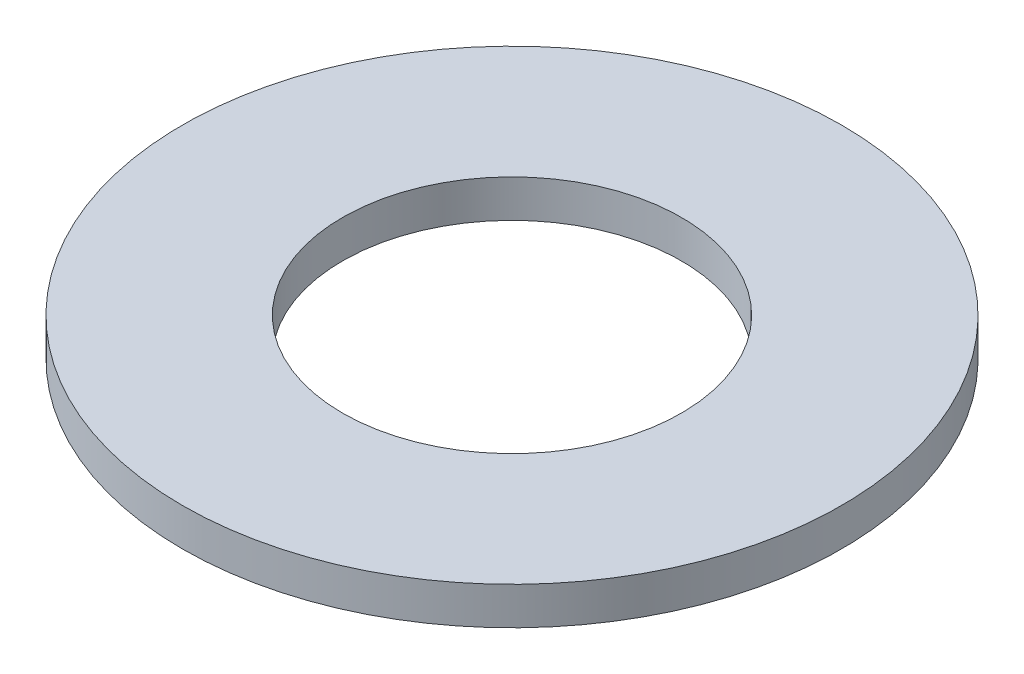
ISO-10303-21;
HEADER;
FILE_DESCRIPTION(('STEP AP214'),'2;1');
FILE_NAME('part.step','',(''),(''),'','','');
FILE_SCHEMA(('AUTOMOTIVE_DESIGN { 1 0 10303 214 1 1 1 1 }'));
ENDSEC;
DATA;
#1=APPLICATION_CONTEXT('core data for automotive mechanical design processes');
#2=APPLICATION_PROTOCOL_DEFINITION('international standard','automotive_design',2000,#1);
#3=PRODUCT_CONTEXT('',#1,'mechanical');
#4=PRODUCT('Part','Part','',(#3));
#5=PRODUCT_RELATED_PRODUCT_CATEGORY('part','',(#4));
#6=PRODUCT_DEFINITION_FORMATION('','',#4);
#7=PRODUCT_DEFINITION_CONTEXT('part definition',#1,'design');
#8=PRODUCT_DEFINITION('design','',#6,#7);
#9=PRODUCT_DEFINITION_SHAPE('','',#8);
#10=(LENGTH_UNIT() NAMED_UNIT(*) SI_UNIT(.MILLI.,.METRE.));
#11=(NAMED_UNIT(*) PLANE_ANGLE_UNIT() SI_UNIT($,.RADIAN.));
#12=(NAMED_UNIT(*) SI_UNIT($,.STERADIAN.) SOLID_ANGLE_UNIT());
#13=UNCERTAINTY_MEASURE_WITH_UNIT(LENGTH_MEASURE(1.E-05),#10,'distance_accuracy_value','');
#14=(GEOMETRIC_REPRESENTATION_CONTEXT(3) GLOBAL_UNCERTAINTY_ASSIGNED_CONTEXT((#13)) GLOBAL_UNIT_ASSIGNED_CONTEXT((#10,
#11,#12)) REPRESENTATION_CONTEXT('',''));
#15=CARTESIAN_POINT('',(0.,0.,0.));
#16=DIRECTION('',(0.,0.,1.));
#17=DIRECTION('',(1.,0.,0.));
#18=AXIS2_PLACEMENT_3D('',#15,#16,#17);
#19=CARTESIAN_POINT('',(0.,10.,0.));
#20=DIRECTION('',(0.,-1.,0.));
#21=DIRECTION('',(0.,0.,-1.));
#22=AXIS2_PLACEMENT_3D('',#19,#20,#21);
#23=CYLINDRICAL_SURFACE('',#22,87.5);
#24=CARTESIAN_POINT('',(0.,10.,0.));
#25=DIRECTION('',(0.,1.,0.));
#26=DIRECTION('',(0.,0.,1.));
#27=AXIS2_PLACEMENT_3D('',#24,#25,#26);
#28=CIRCLE('',#27,87.5);
#29=CARTESIAN_POINT('',(0.,10.,87.5));
#30=VERTEX_POINT('',#29);
#31=EDGE_CURVE('E10',#30,#30,#28,.T.);
#32=ORIENTED_EDGE('',*,*,#31,.F.);
#33=EDGE_LOOP('',(#32));
#34=FACE_BOUND('',#33,.T.);
#35=CARTESIAN_POINT('',(0.,0.,0.));
#36=DIRECTION('',(0.,1.,0.));
#37=DIRECTION('',(0.,0.,1.));
#38=AXIS2_PLACEMENT_3D('',#35,#36,#37);
#39=CIRCLE('',#38,87.5);
#40=CARTESIAN_POINT('',(0.,0.,87.5));
#41=VERTEX_POINT('',#40);
#42=EDGE_CURVE('E37',#41,#41,#39,.T.);
#43=ORIENTED_EDGE('',*,*,#42,.T.);
#44=EDGE_LOOP('',(#43));
#45=FACE_BOUND('',#44,.T.);
#46=ADVANCED_FACE('F40',(#34,#45),#23,.T.);
#47=CARTESIAN_POINT('',(0.,10.,0.));
#48=DIRECTION('',(0.,1.,0.));
#49=DIRECTION('',(0.,0.,1.));
#50=AXIS2_PLACEMENT_3D('',#47,#48,#49);
#51=PLANE('',#50);
#52=CARTESIAN_POINT('',(0.,10.,0.));
#53=DIRECTION('',(0.,1.,0.));
#54=DIRECTION('',(0.,0.,1.));
#55=AXIS2_PLACEMENT_3D('',#52,#53,#54);
#56=CIRCLE('',#55,45.);
#57=CARTESIAN_POINT('',(0.,10.,45.));
#58=VERTEX_POINT('',#57);
#59=EDGE_CURVE('E50',#58,#58,#56,.T.);
#60=ORIENTED_EDGE('',*,*,#59,.F.);
#61=EDGE_LOOP('',(#60));
#62=FACE_BOUND('',#61,.T.);
#63=ORIENTED_EDGE('',*,*,#31,.T.);
#64=EDGE_LOOP('',(#63));
#65=FACE_BOUND('',#64,.T.);
#66=ADVANCED_FACE('F59',(#62,#65),#51,.T.);
#67=CARTESIAN_POINT('',(0.,0.,0.));
#68=DIRECTION('',(0.,1.,0.));
#69=DIRECTION('',(0.,0.,1.));
#70=AXIS2_PLACEMENT_3D('',#67,#68,#69);
#71=PLANE('',#70);
#72=CARTESIAN_POINT('',(0.,0.,0.));
#73=DIRECTION('',(0.,1.,0.));
#74=DIRECTION('',(0.,0.,1.));
#75=AXIS2_PLACEMENT_3D('',#72,#73,#74);
#76=CIRCLE('',#75,45.);
#77=CARTESIAN_POINT('',(0.,0.,45.));
#78=VERTEX_POINT('',#77);
#79=EDGE_CURVE('E47',#78,#78,#76,.T.);
#80=ORIENTED_EDGE('',*,*,#79,.T.);
#81=EDGE_LOOP('',(#80));
#82=FACE_BOUND('',#81,.T.);
#83=ORIENTED_EDGE('',*,*,#42,.F.);
#84=EDGE_LOOP('',(#83));
#85=FACE_BOUND('',#84,.T.);
#86=ADVANCED_FACE('F58',(#82,#85),#71,.F.);
#87=CARTESIAN_POINT('',(0.,10.,0.));
#88=DIRECTION('',(0.,-1.,0.));
#89=DIRECTION('',(0.,0.,-1.));
#90=AXIS2_PLACEMENT_3D('',#87,#88,#89);
#91=CYLINDRICAL_SURFACE('',#90,45.);
#92=ORIENTED_EDGE('',*,*,#59,.T.);
#93=EDGE_LOOP('',(#92));
#94=FACE_BOUND('',#93,.T.);
#95=ORIENTED_EDGE('',*,*,#79,.F.);
#96=EDGE_LOOP('',(#95));
#97=FACE_BOUND('',#96,.T.);
#98=ADVANCED_FACE('F54',(#94,#97),#91,.F.);
#99=CLOSED_SHELL('',(#46,#66,#86,#98));
#100=MANIFOLD_SOLID_BREP('B2',#99);
#101=ADVANCED_BREP_SHAPE_REPRESENTATION('',(#18,#100),#14);
#102=SHAPE_DEFINITION_REPRESENTATION(#9,#101);
ENDSEC;
END-ISO-10303-21;
